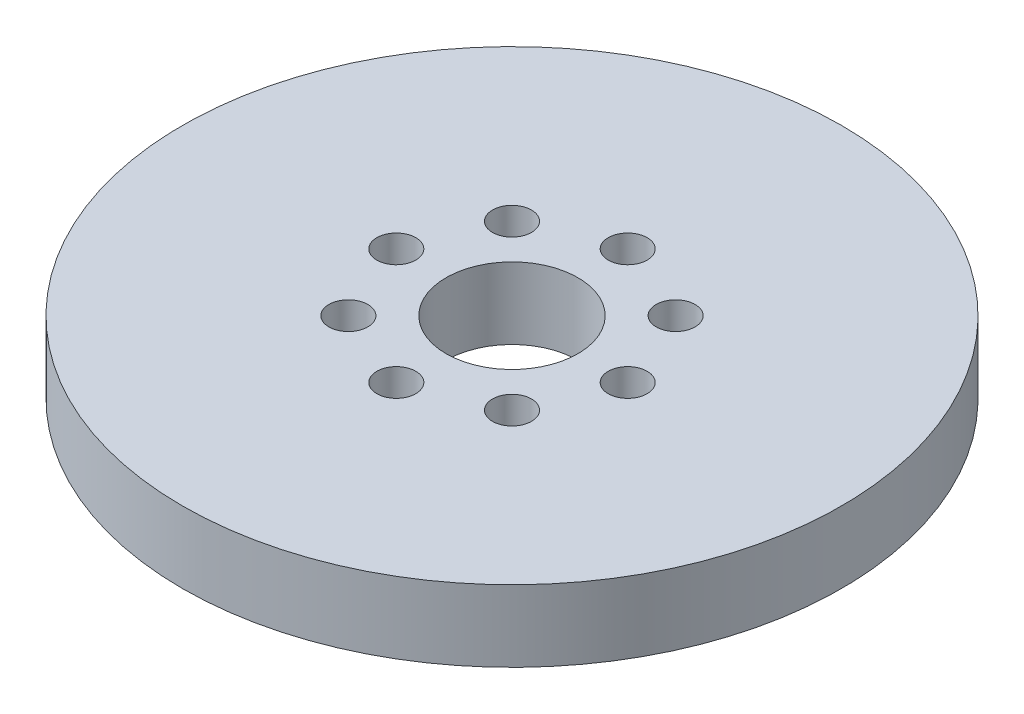
ISO-10303-21;
HEADER;
FILE_DESCRIPTION(('STEP AP214'),'2;1');
FILE_NAME('part.step','',(''),(''),'','','');
FILE_SCHEMA(('AUTOMOTIVE_DESIGN { 1 0 10303 214 1 1 1 1 }'));
ENDSEC;
DATA;
#1=APPLICATION_CONTEXT('core data for automotive mechanical design processes');
#2=APPLICATION_PROTOCOL_DEFINITION('international standard','automotive_design',2000,#1);
#3=PRODUCT_CONTEXT('',#1,'mechanical');
#4=PRODUCT('Part','Part','',(#3));
#5=PRODUCT_RELATED_PRODUCT_CATEGORY('part','',(#4));
#6=PRODUCT_DEFINITION_FORMATION('','',#4);
#7=PRODUCT_DEFINITION_CONTEXT('part definition',#1,'design');
#8=PRODUCT_DEFINITION('design','',#6,#7);
#9=PRODUCT_DEFINITION_SHAPE('','',#8);
#10=(LENGTH_UNIT() NAMED_UNIT(*) SI_UNIT(.MILLI.,.METRE.));
#11=(NAMED_UNIT(*) PLANE_ANGLE_UNIT() SI_UNIT($,.RADIAN.));
#12=(NAMED_UNIT(*) SI_UNIT($,.STERADIAN.) SOLID_ANGLE_UNIT());
#13=UNCERTAINTY_MEASURE_WITH_UNIT(LENGTH_MEASURE(1.E-05),#10,'distance_accuracy_value','');
#14=(GEOMETRIC_REPRESENTATION_CONTEXT(3) GLOBAL_UNCERTAINTY_ASSIGNED_CONTEXT((#13)) GLOBAL_UNIT_ASSIGNED_CONTEXT((#10,
#11,#12)) REPRESENTATION_CONTEXT('',''));
#15=CARTESIAN_POINT('',(0.,0.,0.));
#16=DIRECTION('',(0.,0.,1.));
#17=DIRECTION('',(1.,0.,0.));
#18=AXIS2_PLACEMENT_3D('',#15,#16,#17);
#19=CARTESIAN_POINT('',(0.,19.,0.));
#20=DIRECTION('',(0.,-1.,0.));
#21=DIRECTION('',(0.,0.,-1.));
#22=AXIS2_PLACEMENT_3D('',#19,#20,#21);
#23=CYLINDRICAL_SURFACE('',#22,87.5);
#24=CARTESIAN_POINT('',(0.,19.,0.));
#25=DIRECTION('',(0.,1.,0.));
#26=DIRECTION('',(0.,0.,1.));
#27=AXIS2_PLACEMENT_3D('',#24,#25,#26);
#28=CIRCLE('',#27,87.5);
#29=CARTESIAN_POINT('',(0.,19.,87.5));
#30=VERTEX_POINT('',#29);
#31=EDGE_CURVE('E10',#30,#30,#28,.T.);
#32=ORIENTED_EDGE('',*,*,#31,.F.);
#33=EDGE_LOOP('',(#32));
#34=FACE_BOUND('',#33,.T.);
#35=CARTESIAN_POINT('',(0.,0.,0.));
#36=DIRECTION('',(0.,1.,0.));
#37=DIRECTION('',(0.,0.,1.));
#38=AXIS2_PLACEMENT_3D('',#35,#36,#37);
#39=CIRCLE('',#38,87.5);
#40=CARTESIAN_POINT('',(0.,0.,87.5));
#41=VERTEX_POINT('',#40);
#42=EDGE_CURVE('E37',#41,#41,#39,.T.);
#43=ORIENTED_EDGE('',*,*,#42,.T.);
#44=EDGE_LOOP('',(#43));
#45=FACE_BOUND('',#44,.T.);
#46=ADVANCED_FACE('F40',(#34,#45),#23,.T.);
#47=CARTESIAN_POINT('',(0.,19.,0.));
#48=DIRECTION('',(0.,1.,0.));
#49=DIRECTION('',(0.,0.,1.));
#50=AXIS2_PLACEMENT_3D('',#47,#48,#49);
#51=PLANE('',#50);
#52=CARTESIAN_POINT('',(1.07256722221319E-13,19.,30.7195461788883));
#53=DIRECTION('',(0.,1.,0.));
#54=DIRECTION('',(1.,0.,0.));
#55=AXIS2_PLACEMENT_3D('',#52,#53,#54);
#56=CIRCLE('',#55,5.17098734460073);
#57=CARTESIAN_POINT('',(5.17098734460084,19.,30.7195461788883));
#58=VERTEX_POINT('',#57);
#59=EDGE_CURVE('E88',#58,#58,#56,.T.);
#60=ORIENTED_EDGE('',*,*,#59,.F.);
#61=EDGE_LOOP('',(#60));
#62=FACE_BOUND('',#61,.T.);
#63=CARTESIAN_POINT('',(21.7219994180653,19.,21.7219994180651));
#64=DIRECTION('',(0.,1.,0.));
#65=DIRECTION('',(0.707106781186544,0.,-0.707106781186551));
#66=AXIS2_PLACEMENT_3D('',#63,#64,#65);
#67=CIRCLE('',#66,5.17098734460073);
#68=CARTESIAN_POINT('',(25.3784396348623,19.,18.0655592012681));
#69=VERTEX_POINT('',#68);
#70=EDGE_CURVE('E79',#69,#69,#67,.T.);
#71=ORIENTED_EDGE('',*,*,#70,.F.);
#72=EDGE_LOOP('',(#71));
#73=FACE_BOUND('',#72,.T.);
#74=CARTESIAN_POINT('',(30.7195461788883,19.,0.));
#75=DIRECTION('',(0.,1.,0.));
#76=DIRECTION('',(0.,0.,-1.));
#77=AXIS2_PLACEMENT_3D('',#74,#75,#76);
#78=CIRCLE('',#77,5.17098734460073);
#79=CARTESIAN_POINT('',(30.7195461788883,19.,-5.17098734460073));
#80=VERTEX_POINT('',#79);
#81=EDGE_CURVE('E74',#80,#80,#78,.T.);
#82=ORIENTED_EDGE('',*,*,#81,.F.);
#83=EDGE_LOOP('',(#82));
#84=FACE_BOUND('',#83,.T.);
#85=CARTESIAN_POINT('',(21.721999418065,19.,-21.7219994180654));
#86=DIRECTION('',(0.,1.,0.));
#87=DIRECTION('',(-0.707106781186554,0.,-0.707106781186541));
#88=AXIS2_PLACEMENT_3D('',#85,#86,#87);
#89=CIRCLE('',#88,5.17098734460073);
#90=CARTESIAN_POINT('',(18.065559201268,19.,-25.3784396348624));
#91=VERTEX_POINT('',#90);
#92=EDGE_CURVE('E70',#91,#91,#89,.T.);
#93=ORIENTED_EDGE('',*,*,#92,.F.);
#94=EDGE_LOOP('',(#93));
#95=FACE_BOUND('',#94,.T.);
#96=CARTESIAN_POINT('',(-3.21770166663956E-13,19.,-30.7195461788883));
#97=DIRECTION('',(0.,1.,0.));
#98=DIRECTION('',(-1.,0.,0.));
#99=AXIS2_PLACEMENT_3D('',#96,#97,#98);
#100=CIRCLE('',#99,5.17098734460073);
#101=CARTESIAN_POINT('',(-5.17098734460105,19.,-30.7195461788883));
#102=VERTEX_POINT('',#101);
#103=EDGE_CURVE('E100',#102,#102,#100,.T.);
#104=ORIENTED_EDGE('',*,*,#103,.F.);
#105=EDGE_LOOP('',(#104));
#106=FACE_BOUND('',#105,.T.);
#107=CARTESIAN_POINT('',(-21.7219994180655,19.,-21.721999418065));
#108=DIRECTION('',(0.,1.,0.));
#109=DIRECTION('',(-0.707106781186539,0.,0.707106781186556));
#110=AXIS2_PLACEMENT_3D('',#107,#108,#109);
#111=CIRCLE('',#110,5.17098734460073);
#112=CARTESIAN_POINT('',(-25.3784396348624,19.,-18.0655592012679));
#113=VERTEX_POINT('',#112);
#114=EDGE_CURVE('E93',#113,#113,#111,.T.);
#115=ORIENTED_EDGE('',*,*,#114,.F.);
#116=EDGE_LOOP('',(#115));
#117=FACE_BOUND('',#116,.T.);
#118=CARTESIAN_POINT('',(-21.7219994180652,19.,21.7219994180653));
#119=DIRECTION('',(0.,1.,0.));
#120=DIRECTION('',(0.707106781186549,0.,0.707106781186546));
#121=AXIS2_PLACEMENT_3D('',#118,#119,#120);
#122=CIRCLE('',#121,5.17098734460073);
#123=CARTESIAN_POINT('',(-18.0655592012682,19.,25.3784396348623));
#124=VERTEX_POINT('',#123);
#125=EDGE_CURVE('E61',#124,#124,#122,.T.);
#126=ORIENTED_EDGE('',*,*,#125,.F.);
#127=EDGE_LOOP('',(#126));
#128=FACE_BOUND('',#127,.T.);
#129=CARTESIAN_POINT('',(-30.7195461788883,19.,0.));
#130=DIRECTION('',(0.,1.,0.));
#131=DIRECTION('',(0.,0.,1.));
#132=AXIS2_PLACEMENT_3D('',#129,#130,#131);
#133=CIRCLE('',#132,5.17098734460073);
#134=CARTESIAN_POINT('',(-30.7195461788883,19.,5.17098734460073));
#135=VERTEX_POINT('',#134);
#136=EDGE_CURVE('E54',#135,#135,#133,.T.);
#137=ORIENTED_EDGE('',*,*,#136,.F.);
#138=EDGE_LOOP('',(#137));
#139=FACE_BOUND('',#138,.T.);
#140=CARTESIAN_POINT('',(0.,19.,0.));
#141=DIRECTION('',(0.,1.,0.));
#142=DIRECTION('',(0.,0.,1.));
#143=AXIS2_PLACEMENT_3D('',#140,#141,#142);
#144=CIRCLE('',#143,17.5);
#145=CARTESIAN_POINT('',(0.,19.,17.5));
#146=VERTEX_POINT('',#145);
#147=EDGE_CURVE('E50',#146,#146,#144,.T.);
#148=ORIENTED_EDGE('',*,*,#147,.F.);
#149=EDGE_LOOP('',(#148));
#150=FACE_BOUND('',#149,.T.);
#151=ORIENTED_EDGE('',*,*,#31,.T.);
#152=EDGE_LOOP('',(#151));
#153=FACE_BOUND('',#152,.T.);
#154=ADVANCED_FACE('F115',(#62,#73,#84,#95,#106,#117,#128,#139,#150,#153),#51,.T.);
#155=CARTESIAN_POINT('',(0.,0.,0.));
#156=DIRECTION('',(0.,1.,0.));
#157=DIRECTION('',(0.,0.,1.));
#158=AXIS2_PLACEMENT_3D('',#155,#156,#157);
#159=PLANE('',#158);
#160=CARTESIAN_POINT('',(0.,0.,0.));
#161=DIRECTION('',(0.,1.,0.));
#162=DIRECTION('',(0.,0.,1.));
#163=AXIS2_PLACEMENT_3D('',#160,#161,#162);
#164=CIRCLE('',#163,17.5);
#165=CARTESIAN_POINT('',(0.,0.,17.5));
#166=VERTEX_POINT('',#165);
#167=EDGE_CURVE('E47',#166,#166,#164,.T.);
#168=ORIENTED_EDGE('',*,*,#167,.T.);
#169=EDGE_LOOP('',(#168));
#170=FACE_BOUND('',#169,.T.);
#171=ORIENTED_EDGE('',*,*,#42,.F.);
#172=EDGE_LOOP('',(#171));
#173=FACE_BOUND('',#172,.T.);
#174=ADVANCED_FACE('F113',(#170,#173),#159,.F.);
#175=CARTESIAN_POINT('',(0.,19.,0.));
#176=DIRECTION('',(0.,-1.,0.));
#177=DIRECTION('',(0.,0.,-1.));
#178=AXIS2_PLACEMENT_3D('',#175,#176,#177);
#179=CYLINDRICAL_SURFACE('',#178,17.5);
#180=ORIENTED_EDGE('',*,*,#147,.T.);
#181=EDGE_LOOP('',(#180));
#182=FACE_BOUND('',#181,.T.);
#183=ORIENTED_EDGE('',*,*,#167,.F.);
#184=EDGE_LOOP('',(#183));
#185=FACE_BOUND('',#184,.T.);
#186=ADVANCED_FACE('F127',(#182,#185),#179,.F.);
#187=CARTESIAN_POINT('',(-30.7195461788883,5.05108152136449,0.));
#188=DIRECTION('',(0.,1.,0.));
#189=DIRECTION('',(0.,0.,1.));
#190=AXIS2_PLACEMENT_3D('',#187,#188,#189);
#191=CYLINDRICAL_SURFACE('',#190,5.17098734460073);
#192=CARTESIAN_POINT('',(-30.7195461788883,5.05108152136449,0.));
#193=DIRECTION('',(0.,1.,0.));
#194=DIRECTION('',(0.,0.,1.));
#195=AXIS2_PLACEMENT_3D('',#192,#193,#194);
#196=CIRCLE('',#195,5.17098734460073);
#197=CARTESIAN_POINT('',(-30.7195461788883,5.05108152136449,5.17098734460073));
#198=VERTEX_POINT('',#197);
#199=EDGE_CURVE('E55',#198,#198,#196,.T.);
#200=ORIENTED_EDGE('',*,*,#199,.F.);
#201=EDGE_LOOP('',(#200));
#202=FACE_BOUND('',#201,.T.);
#203=ORIENTED_EDGE('',*,*,#136,.T.);
#204=EDGE_LOOP('',(#203));
#205=FACE_BOUND('',#204,.T.);
#206=ADVANCED_FACE('F129',(#202,#205),#191,.F.);
#207=CARTESIAN_POINT('',(-30.7195461788883,5.05108152136449,0.));
#208=DIRECTION('',(0.,1.,0.));
#209=DIRECTION('',(0.,0.,1.));
#210=AXIS2_PLACEMENT_3D('',#207,#208,#209);
#211=PLANE('',#210);
#212=ORIENTED_EDGE('',*,*,#199,.T.);
#213=EDGE_LOOP('',(#212));
#214=FACE_BOUND('',#213,.T.);
#215=ADVANCED_FACE('F157',(#214),#211,.T.);
#216=CARTESIAN_POINT('',(-21.7219994180652,5.05108152136449,21.7219994180653));
#217=DIRECTION('',(0.,1.,0.));
#218=DIRECTION('',(0.,0.,1.));
#219=AXIS2_PLACEMENT_3D('',#216,#217,#218);
#220=CYLINDRICAL_SURFACE('',#219,5.17098734460073);
#221=CARTESIAN_POINT('',(-21.7219994180652,5.05108152136449,21.7219994180653));
#222=DIRECTION('',(0.,1.,0.));
#223=DIRECTION('',(0.707106781186549,0.,0.707106781186546));
#224=AXIS2_PLACEMENT_3D('',#221,#222,#223);
#225=CIRCLE('',#224,5.17098734460073);
#226=CARTESIAN_POINT('',(-18.0655592012682,5.05108152136449,25.3784396348623));
#227=VERTEX_POINT('',#226);
#228=EDGE_CURVE('E59',#227,#227,#225,.T.);
#229=ORIENTED_EDGE('',*,*,#228,.F.);
#230=EDGE_LOOP('',(#229));
#231=FACE_BOUND('',#230,.T.);
#232=ORIENTED_EDGE('',*,*,#125,.T.);
#233=EDGE_LOOP('',(#232));
#234=FACE_BOUND('',#233,.T.);
#235=ADVANCED_FACE('F170',(#231,#234),#220,.F.);
#236=CARTESIAN_POINT('',(-21.7219994180652,5.05108152136449,21.7219994180653));
#237=DIRECTION('',(0.,1.,0.));
#238=DIRECTION('',(0.707106781186549,0.,0.707106781186546));
#239=AXIS2_PLACEMENT_3D('',#236,#237,#238);
#240=PLANE('',#239);
#241=ORIENTED_EDGE('',*,*,#228,.T.);
#242=EDGE_LOOP('',(#241));
#243=FACE_BOUND('',#242,.T.);
#244=ADVANCED_FACE('F182',(#243),#240,.T.);
#245=CARTESIAN_POINT('',(-21.7219994180655,5.05108152136449,-21.721999418065));
#246=DIRECTION('',(0.,1.,0.));
#247=DIRECTION('',(0.,0.,1.));
#248=AXIS2_PLACEMENT_3D('',#245,#246,#247);
#249=CYLINDRICAL_SURFACE('',#248,5.17098734460073);
#250=CARTESIAN_POINT('',(-21.7219994180655,5.05108152136449,-21.721999418065));
#251=DIRECTION('',(0.,1.,0.));
#252=DIRECTION('',(-0.707106781186539,0.,0.707106781186556));
#253=AXIS2_PLACEMENT_3D('',#250,#251,#252);
#254=CIRCLE('',#253,5.17098734460073);
#255=CARTESIAN_POINT('',(-25.3784396348624,5.05108152136449,-18.0655592012679));
#256=VERTEX_POINT('',#255);
#257=EDGE_CURVE('E94',#256,#256,#254,.T.);
#258=ORIENTED_EDGE('',*,*,#257,.F.);
#259=EDGE_LOOP('',(#258));
#260=FACE_BOUND('',#259,.T.);
#261=ORIENTED_EDGE('',*,*,#114,.T.);
#262=EDGE_LOOP('',(#261));
#263=FACE_BOUND('',#262,.T.);
#264=ADVANCED_FACE('F189',(#260,#263),#249,.F.);
#265=CARTESIAN_POINT('',(-21.7219994180655,5.05108152136449,-21.721999418065));
#266=DIRECTION('',(0.,1.,0.));
#267=DIRECTION('',(-0.707106781186539,0.,0.707106781186556));
#268=AXIS2_PLACEMENT_3D('',#265,#266,#267);
#269=PLANE('',#268);
#270=ORIENTED_EDGE('',*,*,#257,.T.);
#271=EDGE_LOOP('',(#270));
#272=FACE_BOUND('',#271,.T.);
#273=ADVANCED_FACE('F107',(#272),#269,.T.);
#274=CARTESIAN_POINT('',(-3.21770166663956E-13,5.05108152136449,-30.7195461788883));
#275=DIRECTION('',(0.,1.,0.));
#276=DIRECTION('',(0.,0.,1.));
#277=AXIS2_PLACEMENT_3D('',#274,#275,#276);
#278=CYLINDRICAL_SURFACE('',#277,5.17098734460073);
#279=CARTESIAN_POINT('',(-3.21770166663956E-13,5.05108152136449,-30.7195461788883));
#280=DIRECTION('',(0.,1.,0.));
#281=DIRECTION('',(-1.,0.,0.));
#282=AXIS2_PLACEMENT_3D('',#279,#280,#281);
#283=CIRCLE('',#282,5.17098734460073);
#284=CARTESIAN_POINT('',(-5.17098734460105,5.05108152136449,-30.7195461788883));
#285=VERTEX_POINT('',#284);
#286=EDGE_CURVE('E72',#285,#285,#283,.T.);
#287=ORIENTED_EDGE('',*,*,#286,.F.);
#288=EDGE_LOOP('',(#287));
#289=FACE_BOUND('',#288,.T.);
#290=ORIENTED_EDGE('',*,*,#103,.T.);
#291=EDGE_LOOP('',(#290));
#292=FACE_BOUND('',#291,.T.);
#293=ADVANCED_FACE('F104',(#289,#292),#278,.F.);
#294=CARTESIAN_POINT('',(-3.21770166663956E-13,5.05108152136449,-30.7195461788883));
#295=DIRECTION('',(0.,1.,0.));
#296=DIRECTION('',(-1.,0.,0.));
#297=AXIS2_PLACEMENT_3D('',#294,#295,#296);
#298=PLANE('',#297);
#299=ORIENTED_EDGE('',*,*,#286,.T.);
#300=EDGE_LOOP('',(#299));
#301=FACE_BOUND('',#300,.T.);
#302=ADVANCED_FACE('F103',(#301),#298,.T.);
#303=CARTESIAN_POINT('',(21.721999418065,5.05108152136449,-21.7219994180654));
#304=DIRECTION('',(0.,1.,0.));
#305=DIRECTION('',(0.,0.,1.));
#306=AXIS2_PLACEMENT_3D('',#303,#304,#305);
#307=CYLINDRICAL_SURFACE('',#306,5.17098734460073);
#308=CARTESIAN_POINT('',(21.721999418065,5.05108152136449,-21.7219994180654));
#309=DIRECTION('',(0.,1.,0.));
#310=DIRECTION('',(-0.707106781186554,0.,-0.707106781186541));
#311=AXIS2_PLACEMENT_3D('',#308,#309,#310);
#312=CIRCLE('',#311,5.17098734460073);
#313=CARTESIAN_POINT('',(18.065559201268,5.05108152136449,-25.3784396348624));
#314=VERTEX_POINT('',#313);
#315=EDGE_CURVE('E69',#314,#314,#312,.T.);
#316=ORIENTED_EDGE('',*,*,#315,.F.);
#317=EDGE_LOOP('',(#316));
#318=FACE_BOUND('',#317,.T.);
#319=ORIENTED_EDGE('',*,*,#92,.T.);
#320=EDGE_LOOP('',(#319));
#321=FACE_BOUND('',#320,.T.);
#322=ADVANCED_FACE('F219',(#318,#321),#307,.F.);
#323=CARTESIAN_POINT('',(21.721999418065,5.05108152136449,-21.7219994180654));
#324=DIRECTION('',(0.,1.,0.));
#325=DIRECTION('',(-0.707106781186554,0.,-0.707106781186541));
#326=AXIS2_PLACEMENT_3D('',#323,#324,#325);
#327=PLANE('',#326);
#328=ORIENTED_EDGE('',*,*,#315,.T.);
#329=EDGE_LOOP('',(#328));
#330=FACE_BOUND('',#329,.T.);
#331=ADVANCED_FACE('F227',(#330),#327,.T.);
#332=CARTESIAN_POINT('',(30.7195461788883,5.05108152136449,0.));
#333=DIRECTION('',(0.,1.,0.));
#334=DIRECTION('',(0.,0.,1.));
#335=AXIS2_PLACEMENT_3D('',#332,#333,#334);
#336=CYLINDRICAL_SURFACE('',#335,5.17098734460073);
#337=CARTESIAN_POINT('',(30.7195461788883,5.05108152136449,0.));
#338=DIRECTION('',(0.,1.,0.));
#339=DIRECTION('',(0.,0.,-1.));
#340=AXIS2_PLACEMENT_3D('',#337,#338,#339);
#341=CIRCLE('',#340,5.17098734460073);
#342=CARTESIAN_POINT('',(30.7195461788883,5.05108152136449,-5.17098734460073));
#343=VERTEX_POINT('',#342);
#344=EDGE_CURVE('E80',#343,#343,#341,.T.);
#345=ORIENTED_EDGE('',*,*,#344,.F.);
#346=EDGE_LOOP('',(#345));
#347=FACE_BOUND('',#346,.T.);
#348=ORIENTED_EDGE('',*,*,#81,.T.);
#349=EDGE_LOOP('',(#348));
#350=FACE_BOUND('',#349,.T.);
#351=ADVANCED_FACE('F240',(#347,#350),#336,.F.);
#352=CARTESIAN_POINT('',(30.7195461788883,5.05108152136449,0.));
#353=DIRECTION('',(0.,1.,0.));
#354=DIRECTION('',(0.,0.,-1.));
#355=AXIS2_PLACEMENT_3D('',#352,#353,#354);
#356=PLANE('',#355);
#357=ORIENTED_EDGE('',*,*,#344,.T.);
#358=EDGE_LOOP('',(#357));
#359=FACE_BOUND('',#358,.T.);
#360=ADVANCED_FACE('F246',(#359),#356,.T.);
#361=CARTESIAN_POINT('',(21.7219994180653,5.05108152136449,21.7219994180651));
#362=DIRECTION('',(0.,1.,0.));
#363=DIRECTION('',(0.,0.,1.));
#364=AXIS2_PLACEMENT_3D('',#361,#362,#363);
#365=CYLINDRICAL_SURFACE('',#364,5.17098734460073);
#366=CARTESIAN_POINT('',(21.7219994180653,5.05108152136449,21.7219994180651));
#367=DIRECTION('',(0.,1.,0.));
#368=DIRECTION('',(0.707106781186544,0.,-0.707106781186551));
#369=AXIS2_PLACEMENT_3D('',#366,#367,#368);
#370=CIRCLE('',#369,5.17098734460073);
#371=CARTESIAN_POINT('',(25.3784396348623,5.05108152136449,18.0655592012681));
#372=VERTEX_POINT('',#371);
#373=EDGE_CURVE('E82',#372,#372,#370,.T.);
#374=ORIENTED_EDGE('',*,*,#373,.F.);
#375=EDGE_LOOP('',(#374));
#376=FACE_BOUND('',#375,.T.);
#377=ORIENTED_EDGE('',*,*,#70,.T.);
#378=EDGE_LOOP('',(#377));
#379=FACE_BOUND('',#378,.T.);
#380=ADVANCED_FACE('F254',(#376,#379),#365,.F.);
#381=CARTESIAN_POINT('',(21.7219994180653,5.05108152136449,21.7219994180651));
#382=DIRECTION('',(0.,1.,0.));
#383=DIRECTION('',(0.707106781186544,0.,-0.707106781186551));
#384=AXIS2_PLACEMENT_3D('',#381,#382,#383);
#385=PLANE('',#384);
#386=ORIENTED_EDGE('',*,*,#373,.T.);
#387=EDGE_LOOP('',(#386));
#388=FACE_BOUND('',#387,.T.);
#389=ADVANCED_FACE('F262',(#388),#385,.T.);
#390=CARTESIAN_POINT('',(1.07256722221319E-13,5.05108152136449,30.7195461788883));
#391=DIRECTION('',(0.,1.,0.));
#392=DIRECTION('',(0.,0.,1.));
#393=AXIS2_PLACEMENT_3D('',#390,#391,#392);
#394=CYLINDRICAL_SURFACE('',#393,5.17098734460073);
#395=CARTESIAN_POINT('',(1.07256722221319E-13,5.05108152136449,30.7195461788883));
#396=DIRECTION('',(0.,1.,0.));
#397=DIRECTION('',(1.,0.,0.));
#398=AXIS2_PLACEMENT_3D('',#395,#396,#397);
#399=CIRCLE('',#398,5.17098734460073);
#400=CARTESIAN_POINT('',(5.17098734460084,5.05108152136449,30.7195461788883));
#401=VERTEX_POINT('',#400);
#402=EDGE_CURVE('E63',#401,#401,#399,.T.);
#403=ORIENTED_EDGE('',*,*,#402,.F.);
#404=EDGE_LOOP('',(#403));
#405=FACE_BOUND('',#404,.T.);
#406=ORIENTED_EDGE('',*,*,#59,.T.);
#407=EDGE_LOOP('',(#406));
#408=FACE_BOUND('',#407,.T.);
#409=ADVANCED_FACE('F272',(#405,#408),#394,.F.);
#410=CARTESIAN_POINT('',(1.07256722221319E-13,5.05108152136449,30.7195461788883));
#411=DIRECTION('',(0.,1.,0.));
#412=DIRECTION('',(1.,0.,0.));
#413=AXIS2_PLACEMENT_3D('',#410,#411,#412);
#414=PLANE('',#413);
#415=ORIENTED_EDGE('',*,*,#402,.T.);
#416=EDGE_LOOP('',(#415));
#417=FACE_BOUND('',#416,.T.);
#418=ADVANCED_FACE('F285',(#417),#414,.T.);
#419=CLOSED_SHELL('',(#46,#154,#174,#186,#206,#215,#235,#244,#264,#273,#293,#302,#322,#331,#351,
#360,#380,#389,#409,#418));
#420=MANIFOLD_SOLID_BREP('B2',#419);
#421=ADVANCED_BREP_SHAPE_REPRESENTATION('',(#18,#420),#14);
#422=SHAPE_DEFINITION_REPRESENTATION(#9,#421);
ENDSEC;
END-ISO-10303-21;
